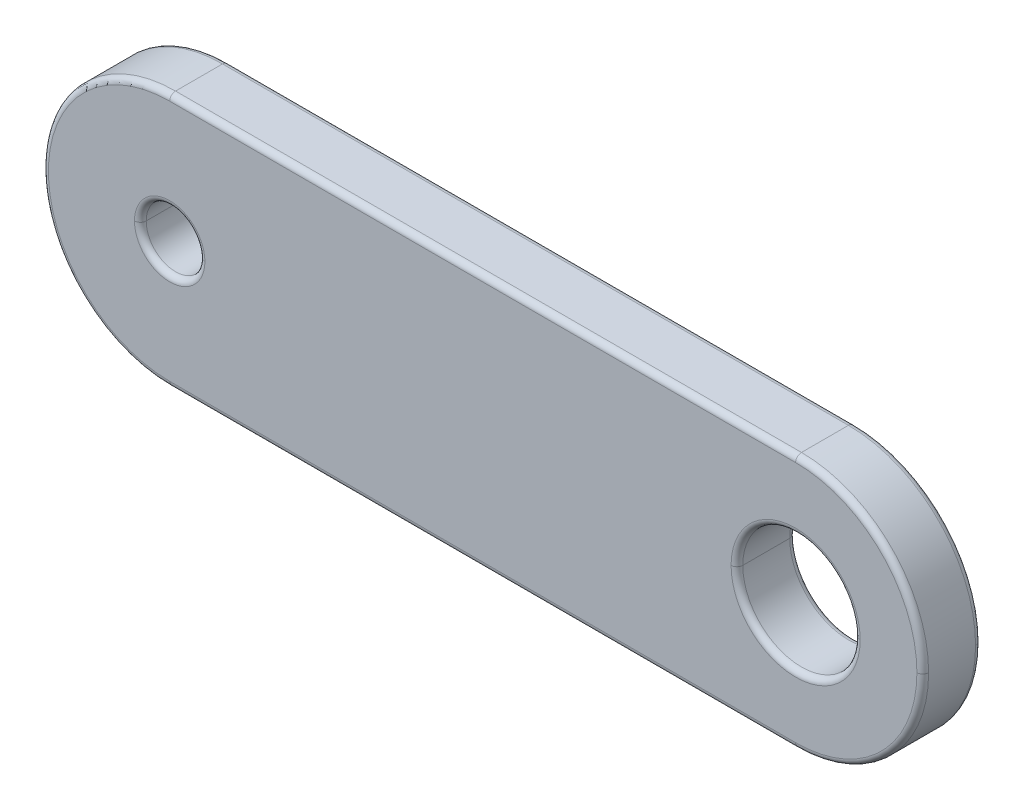
ISO-10303-21;
HEADER;
FILE_DESCRIPTION(('STEP AP214'),'2;1');
FILE_NAME('part.step','',(''),(''),'','','');
FILE_SCHEMA(('AUTOMOTIVE_DESIGN { 1 0 10303 214 1 1 1 1 }'));
ENDSEC;
DATA;
#1=APPLICATION_CONTEXT('core data for automotive mechanical design processes');
#2=APPLICATION_PROTOCOL_DEFINITION('international standard','automotive_design',2000,#1);
#3=PRODUCT_CONTEXT('',#1,'mechanical');
#4=PRODUCT('Part','Part','',(#3));
#5=PRODUCT_RELATED_PRODUCT_CATEGORY('part','',(#4));
#6=PRODUCT_DEFINITION_FORMATION('','',#4);
#7=PRODUCT_DEFINITION_CONTEXT('part definition',#1,'design');
#8=PRODUCT_DEFINITION('design','',#6,#7);
#9=PRODUCT_DEFINITION_SHAPE('','',#8);
#10=(LENGTH_UNIT() NAMED_UNIT(*) SI_UNIT(.MILLI.,.METRE.));
#11=(NAMED_UNIT(*) PLANE_ANGLE_UNIT() SI_UNIT($,.RADIAN.));
#12=(NAMED_UNIT(*) SI_UNIT($,.STERADIAN.) SOLID_ANGLE_UNIT());
#13=UNCERTAINTY_MEASURE_WITH_UNIT(LENGTH_MEASURE(1.E-05),#10,'distance_accuracy_value','');
#14=(GEOMETRIC_REPRESENTATION_CONTEXT(3) GLOBAL_UNCERTAINTY_ASSIGNED_CONTEXT((#13)) GLOBAL_UNIT_ASSIGNED_CONTEXT((#10,
#11,#12)) REPRESENTATION_CONTEXT('',''));
#15=CARTESIAN_POINT('',(0.,0.,0.));
#16=DIRECTION('',(0.,0.,1.));
#17=DIRECTION('',(1.,0.,0.));
#18=AXIS2_PLACEMENT_3D('',#15,#16,#17);
#19=CARTESIAN_POINT('',(-8.,0.,0.6));
#20=DIRECTION('',(0.,0.,1.));
#21=DIRECTION('',(1.,0.,0.));
#22=AXIS2_PLACEMENT_3D('',#19,#20,#21);
#23=TOROIDAL_SURFACE('',#22,0.9,0.15);
#24=CARTESIAN_POINT('',(-8.9,0.,0.6));
#25=DIRECTION('',(0.,1.,0.));
#26=DIRECTION('',(-1.,0.,0.));
#27=AXIS2_PLACEMENT_3D('',#24,#25,#26);
#28=CIRCLE('',#27,0.15);
#29=CARTESIAN_POINT('',(-8.9,0.,0.75));
#30=VERTEX_POINT('',#29);
#31=CARTESIAN_POINT('',(-8.75,0.,0.6));
#32=VERTEX_POINT('',#31);
#33=EDGE_CURVE('E339',#30,#32,#28,.T.);
#34=ORIENTED_EDGE('',*,*,#33,.F.);
#35=CARTESIAN_POINT('',(-8.,0.,0.75));
#36=DIRECTION('',(0.,0.,-1.));
#37=DIRECTION('',(1.,0.,0.));
#38=AXIS2_PLACEMENT_3D('',#35,#36,#37);
#39=CIRCLE('',#38,0.9);
#40=CARTESIAN_POINT('',(-7.1,0.,0.75));
#41=VERTEX_POINT('',#40);
#42=EDGE_CURVE('E276',#41,#30,#39,.T.);
#43=ORIENTED_EDGE('',*,*,#42,.F.);
#44=CARTESIAN_POINT('',(-7.1,0.,0.6));
#45=DIRECTION('',(0.,-1.,0.));
#46=DIRECTION('',(0.,0.,-1.));
#47=AXIS2_PLACEMENT_3D('',#44,#45,#46);
#48=CIRCLE('',#47,0.15);
#49=CARTESIAN_POINT('',(-7.25,0.,0.6));
#50=VERTEX_POINT('',#49);
#51=EDGE_CURVE('E379',#41,#50,#48,.T.);
#52=ORIENTED_EDGE('',*,*,#51,.T.);
#53=CARTESIAN_POINT('',(-8.,0.,0.6));
#54=DIRECTION('',(0.,0.,1.));
#55=DIRECTION('',(1.,0.,0.));
#56=AXIS2_PLACEMENT_3D('',#53,#54,#55);
#57=CIRCLE('',#56,0.75);
#58=EDGE_CURVE('E307',#32,#50,#57,.T.);
#59=ORIENTED_EDGE('',*,*,#58,.F.);
#60=EDGE_LOOP('',(#34,#43,#52,#59));
#61=FACE_BOUND('',#60,.T.);
#62=ADVANCED_FACE('F15',(#61),#23,.T.);
#63=CARTESIAN_POINT('',(-8.,3.1,0.6));
#64=DIRECTION('',(1.,0.,0.));
#65=DIRECTION('',(0.,1.,0.));
#66=AXIS2_PLACEMENT_3D('',#63,#64,#65);
#67=CYLINDRICAL_SURFACE('',#66,0.15);
#68=CARTESIAN_POINT('',(8.,3.1,0.6));
#69=DIRECTION('',(-1.,0.,0.));
#70=DIRECTION('',(0.,0.,1.));
#71=AXIS2_PLACEMENT_3D('',#68,#69,#70);
#72=CIRCLE('',#71,0.15);
#73=CARTESIAN_POINT('',(8.,3.1,0.75));
#74=VERTEX_POINT('',#73);
#75=CARTESIAN_POINT('',(8.,3.25,0.6));
#76=VERTEX_POINT('',#75);
#77=EDGE_CURVE('E26',#74,#76,#72,.T.);
#78=ORIENTED_EDGE('',*,*,#77,.T.);
#79=DIRECTION('',(1.,0.,0.));
#80=VECTOR('',#79,1.);
#81=CARTESIAN_POINT('',(8.,3.25,0.6));
#82=LINE('',#81,#80);
#83=CARTESIAN_POINT('',(-8.,3.25,0.6));
#84=VERTEX_POINT('',#83);
#85=EDGE_CURVE('E193',#84,#76,#82,.T.);
#86=ORIENTED_EDGE('',*,*,#85,.F.);
#87=CARTESIAN_POINT('',(-8.,3.1,0.6));
#88=DIRECTION('',(1.,0.,0.));
#89=DIRECTION('',(0.,0.,-1.));
#90=AXIS2_PLACEMENT_3D('',#87,#88,#89);
#91=CIRCLE('',#90,0.15);
#92=CARTESIAN_POINT('',(-8.,3.1,0.75));
#93=VERTEX_POINT('',#92);
#94=EDGE_CURVE('E10',#84,#93,#91,.T.);
#95=ORIENTED_EDGE('',*,*,#94,.T.);
#96=DIRECTION('',(-1.,0.,0.));
#97=VECTOR('',#96,1.);
#98=CARTESIAN_POINT('',(-8.,3.1,0.75));
#99=LINE('',#98,#97);
#100=EDGE_CURVE('E191',#74,#93,#99,.T.);
#101=ORIENTED_EDGE('',*,*,#100,.F.);
#102=EDGE_LOOP('',(#78,#86,#95,#101));
#103=FACE_BOUND('',#102,.T.);
#104=ADVANCED_FACE('F189',(#103),#67,.T.);
#105=CARTESIAN_POINT('',(-8.,0.,0.6));
#106=DIRECTION('',(0.,0.,1.));
#107=DIRECTION('',(1.,0.,0.));
#108=AXIS2_PLACEMENT_3D('',#105,#106,#107);
#109=TOROIDAL_SURFACE('',#108,3.1,0.15);
#110=CARTESIAN_POINT('',(-8.,-3.1,0.6));
#111=DIRECTION('',(-1.,0.,0.));
#112=DIRECTION('',(0.,0.,1.));
#113=AXIS2_PLACEMENT_3D('',#110,#111,#112);
#114=CIRCLE('',#113,0.15);
#115=CARTESIAN_POINT('',(-8.,-3.25,0.6));
#116=VERTEX_POINT('',#115);
#117=CARTESIAN_POINT('',(-8.,-3.1,0.75));
#118=VERTEX_POINT('',#117);
#119=EDGE_CURVE('E201',#116,#118,#114,.T.);
#120=ORIENTED_EDGE('',*,*,#119,.T.);
#121=CARTESIAN_POINT('',(-8.,0.,0.75));
#122=DIRECTION('',(0.,0.,1.));
#123=DIRECTION('',(1.,0.,0.));
#124=AXIS2_PLACEMENT_3D('',#121,#122,#123);
#125=CIRCLE('',#124,3.1);
#126=EDGE_CURVE('E197',#93,#118,#125,.T.);
#127=ORIENTED_EDGE('',*,*,#126,.F.);
#128=ORIENTED_EDGE('',*,*,#94,.F.);
#129=CARTESIAN_POINT('',(-8.,0.,0.6));
#130=DIRECTION('',(0.,0.,-1.));
#131=DIRECTION('',(1.,0.,0.));
#132=AXIS2_PLACEMENT_3D('',#129,#130,#131);
#133=CIRCLE('',#132,3.25);
#134=CARTESIAN_POINT('',(-11.25,0.,0.6));
#135=VERTEX_POINT('',#134);
#136=EDGE_CURVE('E263',#135,#84,#133,.T.);
#137=ORIENTED_EDGE('',*,*,#136,.F.);
#138=CARTESIAN_POINT('',(-8.,0.,0.6));
#139=DIRECTION('',(0.,0.,-1.));
#140=DIRECTION('',(1.,0.,0.));
#141=AXIS2_PLACEMENT_3D('',#138,#139,#140);
#142=CIRCLE('',#141,3.25);
#143=EDGE_CURVE('E332',#116,#135,#142,.T.);
#144=ORIENTED_EDGE('',*,*,#143,.F.);
#145=EDGE_LOOP('',(#120,#127,#128,#137,#144));
#146=FACE_BOUND('',#145,.T.);
#147=ADVANCED_FACE('F198',(#146),#109,.T.);
#148=CARTESIAN_POINT('',(8.,0.,0.6));
#149=DIRECTION('',(0.,0.,1.));
#150=DIRECTION('',(1.,0.,0.));
#151=AXIS2_PLACEMENT_3D('',#148,#149,#150);
#152=TOROIDAL_SURFACE('',#151,3.1,0.15);
#153=CARTESIAN_POINT('',(11.1,0.,0.6));
#154=DIRECTION('',(0.,-1.,0.));
#155=DIRECTION('',(0.,0.,-1.));
#156=AXIS2_PLACEMENT_3D('',#153,#154,#155);
#157=CIRCLE('',#156,0.15);
#158=CARTESIAN_POINT('',(11.25,0.,0.6));
#159=VERTEX_POINT('',#158);
#160=CARTESIAN_POINT('',(11.1,0.,0.75));
#161=VERTEX_POINT('',#160);
#162=EDGE_CURVE('E239',#159,#161,#157,.T.);
#163=ORIENTED_EDGE('',*,*,#162,.F.);
#164=CARTESIAN_POINT('',(8.,0.,0.6));
#165=DIRECTION('',(0.,0.,-1.));
#166=DIRECTION('',(1.,0.,0.));
#167=AXIS2_PLACEMENT_3D('',#164,#165,#166);
#168=CIRCLE('',#167,3.25);
#169=EDGE_CURVE('E285',#76,#159,#168,.T.);
#170=ORIENTED_EDGE('',*,*,#169,.F.);
#171=ORIENTED_EDGE('',*,*,#77,.F.);
#172=CARTESIAN_POINT('',(8.,0.,0.75));
#173=DIRECTION('',(0.,0.,1.));
#174=DIRECTION('',(1.,0.,0.));
#175=AXIS2_PLACEMENT_3D('',#172,#173,#174);
#176=CIRCLE('',#175,3.1);
#177=EDGE_CURVE('E209',#161,#74,#176,.T.);
#178=ORIENTED_EDGE('',*,*,#177,.F.);
#179=EDGE_LOOP('',(#163,#170,#171,#178));
#180=FACE_BOUND('',#179,.T.);
#181=ADVANCED_FACE('F517',(#180),#152,.T.);
#182=CARTESIAN_POINT('',(-8.,-3.1,0.6));
#183=DIRECTION('',(-1.,0.,0.));
#184=DIRECTION('',(0.,-1.,0.));
#185=AXIS2_PLACEMENT_3D('',#182,#183,#184);
#186=CYLINDRICAL_SURFACE('',#185,0.15);
#187=ORIENTED_EDGE('',*,*,#119,.F.);
#188=DIRECTION('',(-1.,0.,0.));
#189=VECTOR('',#188,1.);
#190=CARTESIAN_POINT('',(-8.,-3.25,0.6));
#191=LINE('',#190,#189);
#192=CARTESIAN_POINT('',(8.,-3.25,0.6));
#193=VERTEX_POINT('',#192);
#194=EDGE_CURVE('E294',#193,#116,#191,.T.);
#195=ORIENTED_EDGE('',*,*,#194,.F.);
#196=CARTESIAN_POINT('',(8.,-3.1,0.6));
#197=DIRECTION('',(1.,0.,0.));
#198=DIRECTION('',(0.,0.,-1.));
#199=AXIS2_PLACEMENT_3D('',#196,#197,#198);
#200=CIRCLE('',#199,0.15);
#201=CARTESIAN_POINT('',(8.,-3.1,0.75));
#202=VERTEX_POINT('',#201);
#203=EDGE_CURVE('E249',#202,#193,#200,.T.);
#204=ORIENTED_EDGE('',*,*,#203,.F.);
#205=DIRECTION('',(1.,0.,0.));
#206=VECTOR('',#205,1.);
#207=CARTESIAN_POINT('',(8.,-3.1,0.75));
#208=LINE('',#207,#206);
#209=EDGE_CURVE('E205',#118,#202,#208,.T.);
#210=ORIENTED_EDGE('',*,*,#209,.F.);
#211=EDGE_LOOP('',(#187,#195,#204,#210));
#212=FACE_BOUND('',#211,.T.);
#213=ADVANCED_FACE('F514',(#212),#186,.T.);
#214=CARTESIAN_POINT('',(8.,0.,0.6));
#215=DIRECTION('',(0.,0.,1.));
#216=DIRECTION('',(1.,0.,0.));
#217=AXIS2_PLACEMENT_3D('',#214,#215,#216);
#218=TOROIDAL_SURFACE('',#217,1.65,0.15);
#219=CARTESIAN_POINT('',(6.35,0.,0.6));
#220=DIRECTION('',(0.,1.,0.));
#221=DIRECTION('',(-1.,0.,0.));
#222=AXIS2_PLACEMENT_3D('',#219,#220,#221);
#223=CIRCLE('',#222,0.15);
#224=CARTESIAN_POINT('',(6.35,0.,0.75));
#225=VERTEX_POINT('',#224);
#226=CARTESIAN_POINT('',(6.5,0.,0.6));
#227=VERTEX_POINT('',#226);
#228=EDGE_CURVE('E226',#225,#227,#223,.T.);
#229=ORIENTED_EDGE('',*,*,#228,.F.);
#230=CARTESIAN_POINT('',(8.,0.,0.75));
#231=DIRECTION('',(0.,0.,-1.));
#232=DIRECTION('',(1.,0.,0.));
#233=AXIS2_PLACEMENT_3D('',#230,#231,#232);
#234=CIRCLE('',#233,1.65);
#235=CARTESIAN_POINT('',(9.65,0.,0.75));
#236=VERTEX_POINT('',#235);
#237=EDGE_CURVE('E392',#236,#225,#234,.T.);
#238=ORIENTED_EDGE('',*,*,#237,.F.);
#239=CARTESIAN_POINT('',(9.65,0.,0.6));
#240=DIRECTION('',(0.,-1.,0.));
#241=DIRECTION('',(0.,0.,-1.));
#242=AXIS2_PLACEMENT_3D('',#239,#240,#241);
#243=CIRCLE('',#242,0.15);
#244=CARTESIAN_POINT('',(9.5,0.,0.6));
#245=VERTEX_POINT('',#244);
#246=EDGE_CURVE('E225',#236,#245,#243,.T.);
#247=ORIENTED_EDGE('',*,*,#246,.T.);
#248=CARTESIAN_POINT('',(8.,0.,0.6));
#249=DIRECTION('',(0.,0.,1.));
#250=DIRECTION('',(1.,0.,0.));
#251=AXIS2_PLACEMENT_3D('',#248,#249,#250);
#252=CIRCLE('',#251,1.5);
#253=EDGE_CURVE('E309',#227,#245,#252,.T.);
#254=ORIENTED_EDGE('',*,*,#253,.F.);
#255=EDGE_LOOP('',(#229,#238,#247,#254));
#256=FACE_BOUND('',#255,.T.);
#257=ADVANCED_FACE('F17',(#256),#218,.T.);
#258=CARTESIAN_POINT('',(-8.,-3.1,-0.6));
#259=DIRECTION('',(1.,0.,0.));
#260=DIRECTION('',(0.,1.,0.));
#261=AXIS2_PLACEMENT_3D('',#258,#259,#260);
#262=CYLINDRICAL_SURFACE('',#261,0.15);
#263=CARTESIAN_POINT('',(-8.,-3.1,-0.6));
#264=DIRECTION('',(1.,0.,0.));
#265=DIRECTION('',(0.,0.,-1.));
#266=AXIS2_PLACEMENT_3D('',#263,#264,#265);
#267=CIRCLE('',#266,0.15);
#268=CARTESIAN_POINT('',(-8.,-3.25,-0.6));
#269=VERTEX_POINT('',#268);
#270=CARTESIAN_POINT('',(-8.,-3.1,-0.75));
#271=VERTEX_POINT('',#270);
#272=EDGE_CURVE('E250',#269,#271,#267,.T.);
#273=ORIENTED_EDGE('',*,*,#272,.T.);
#274=DIRECTION('',(-1.,0.,0.));
#275=VECTOR('',#274,1.);
#276=CARTESIAN_POINT('',(-8.,-3.1,-0.75));
#277=LINE('',#276,#275);
#278=CARTESIAN_POINT('',(8.,-3.1,-0.75));
#279=VERTEX_POINT('',#278);
#280=EDGE_CURVE('E238',#279,#271,#277,.T.);
#281=ORIENTED_EDGE('',*,*,#280,.F.);
#282=CARTESIAN_POINT('',(8.,-3.1,-0.6));
#283=DIRECTION('',(-1.,0.,0.));
#284=DIRECTION('',(0.,0.,1.));
#285=AXIS2_PLACEMENT_3D('',#282,#283,#284);
#286=CIRCLE('',#285,0.15);
#287=CARTESIAN_POINT('',(8.,-3.25,-0.6));
#288=VERTEX_POINT('',#287);
#289=EDGE_CURVE('E227',#279,#288,#286,.T.);
#290=ORIENTED_EDGE('',*,*,#289,.T.);
#291=DIRECTION('',(1.,0.,0.));
#292=VECTOR('',#291,1.);
#293=CARTESIAN_POINT('',(-8.,-3.25,-0.6));
#294=LINE('',#293,#292);
#295=EDGE_CURVE('E268',#269,#288,#294,.T.);
#296=ORIENTED_EDGE('',*,*,#295,.F.);
#297=EDGE_LOOP('',(#273,#281,#290,#296));
#298=FACE_BOUND('',#297,.T.);
#299=ADVANCED_FACE('F509',(#298),#262,.T.);
#300=CARTESIAN_POINT('',(8.,0.,-0.6));
#301=DIRECTION('',(0.,0.,1.));
#302=DIRECTION('',(1.,0.,0.));
#303=AXIS2_PLACEMENT_3D('',#300,#301,#302);
#304=TOROIDAL_SURFACE('',#303,3.1,0.15);
#305=CARTESIAN_POINT('',(11.1,0.,-0.6));
#306=DIRECTION('',(0.,-1.,0.));
#307=DIRECTION('',(0.,0.,-1.));
#308=AXIS2_PLACEMENT_3D('',#305,#306,#307);
#309=CIRCLE('',#308,0.15);
#310=CARTESIAN_POINT('',(11.1,0.,-0.75));
#311=VERTEX_POINT('',#310);
#312=CARTESIAN_POINT('',(11.25,0.,-0.6));
#313=VERTEX_POINT('',#312);
#314=EDGE_CURVE('E380',#311,#313,#309,.T.);
#315=ORIENTED_EDGE('',*,*,#314,.F.);
#316=CARTESIAN_POINT('',(8.,0.,-0.75));
#317=DIRECTION('',(0.,0.,-1.));
#318=DIRECTION('',(1.,0.,0.));
#319=AXIS2_PLACEMENT_3D('',#316,#317,#318);
#320=CIRCLE('',#319,3.1);
#321=CARTESIAN_POINT('',(8.,3.1,-0.75));
#322=VERTEX_POINT('',#321);
#323=EDGE_CURVE('E158',#322,#311,#320,.T.);
#324=ORIENTED_EDGE('',*,*,#323,.F.);
#325=CARTESIAN_POINT('',(8.,3.1,-0.6));
#326=DIRECTION('',(1.,0.,0.));
#327=DIRECTION('',(0.,0.,-1.));
#328=AXIS2_PLACEMENT_3D('',#325,#326,#327);
#329=CIRCLE('',#328,0.15);
#330=CARTESIAN_POINT('',(8.,3.25,-0.6));
#331=VERTEX_POINT('',#330);
#332=EDGE_CURVE('E272',#322,#331,#329,.T.);
#333=ORIENTED_EDGE('',*,*,#332,.T.);
#334=CARTESIAN_POINT('',(8.,0.,-0.6));
#335=DIRECTION('',(0.,0.,1.));
#336=DIRECTION('',(1.,0.,0.));
#337=AXIS2_PLACEMENT_3D('',#334,#335,#336);
#338=CIRCLE('',#337,3.25);
#339=EDGE_CURVE('E286',#313,#331,#338,.T.);
#340=ORIENTED_EDGE('',*,*,#339,.F.);
#341=EDGE_LOOP('',(#315,#324,#333,#340));
#342=FACE_BOUND('',#341,.T.);
#343=ADVANCED_FACE('F512',(#342),#304,.T.);
#344=CARTESIAN_POINT('',(-8.,0.,-0.6));
#345=DIRECTION('',(0.,0.,1.));
#346=DIRECTION('',(1.,0.,0.));
#347=AXIS2_PLACEMENT_3D('',#344,#345,#346);
#348=TOROIDAL_SURFACE('',#347,3.1,0.15);
#349=CARTESIAN_POINT('',(-8.,3.1,-0.6));
#350=DIRECTION('',(-1.,0.,0.));
#351=DIRECTION('',(0.,0.,1.));
#352=AXIS2_PLACEMENT_3D('',#349,#350,#351);
#353=CIRCLE('',#352,0.15);
#354=CARTESIAN_POINT('',(-8.,3.25,-0.6));
#355=VERTEX_POINT('',#354);
#356=CARTESIAN_POINT('',(-8.,3.1,-0.75));
#357=VERTEX_POINT('',#356);
#358=EDGE_CURVE('E253',#355,#357,#353,.T.);
#359=ORIENTED_EDGE('',*,*,#358,.T.);
#360=CARTESIAN_POINT('',(-8.,0.,-0.75));
#361=DIRECTION('',(0.,0.,-1.));
#362=DIRECTION('',(1.,0.,0.));
#363=AXIS2_PLACEMENT_3D('',#360,#361,#362);
#364=CIRCLE('',#363,3.1);
#365=EDGE_CURVE('E233',#271,#357,#364,.T.);
#366=ORIENTED_EDGE('',*,*,#365,.F.);
#367=ORIENTED_EDGE('',*,*,#272,.F.);
#368=CARTESIAN_POINT('',(-8.,0.,-0.6));
#369=DIRECTION('',(0.,0.,1.));
#370=DIRECTION('',(1.,0.,0.));
#371=AXIS2_PLACEMENT_3D('',#368,#369,#370);
#372=CIRCLE('',#371,3.25);
#373=CARTESIAN_POINT('',(-11.25,0.,-0.6));
#374=VERTEX_POINT('',#373);
#375=EDGE_CURVE('E256',#374,#269,#372,.T.);
#376=ORIENTED_EDGE('',*,*,#375,.F.);
#377=CARTESIAN_POINT('',(-8.,0.,-0.6));
#378=DIRECTION('',(0.,0.,1.));
#379=DIRECTION('',(1.,0.,0.));
#380=AXIS2_PLACEMENT_3D('',#377,#378,#379);
#381=CIRCLE('',#380,3.25);
#382=EDGE_CURVE('E265',#355,#374,#381,.T.);
#383=ORIENTED_EDGE('',*,*,#382,.F.);
#384=EDGE_LOOP('',(#359,#366,#367,#376,#383));
#385=FACE_BOUND('',#384,.T.);
#386=ADVANCED_FACE('F532',(#385),#348,.T.);
#387=CARTESIAN_POINT('',(-8.,3.1,-0.6));
#388=DIRECTION('',(-1.,0.,0.));
#389=DIRECTION('',(0.,-1.,0.));
#390=AXIS2_PLACEMENT_3D('',#387,#388,#389);
#391=CYLINDRICAL_SURFACE('',#390,0.15);
#392=ORIENTED_EDGE('',*,*,#332,.F.);
#393=DIRECTION('',(1.,0.,0.));
#394=VECTOR('',#393,1.);
#395=CARTESIAN_POINT('',(-8.,3.1,-0.75));
#396=LINE('',#395,#394);
#397=EDGE_CURVE('E237',#357,#322,#396,.T.);
#398=ORIENTED_EDGE('',*,*,#397,.F.);
#399=ORIENTED_EDGE('',*,*,#358,.F.);
#400=DIRECTION('',(-1.,0.,0.));
#401=VECTOR('',#400,1.);
#402=CARTESIAN_POINT('',(-8.,3.25,-0.6));
#403=LINE('',#402,#401);
#404=EDGE_CURVE('E273',#331,#355,#403,.T.);
#405=ORIENTED_EDGE('',*,*,#404,.F.);
#406=EDGE_LOOP('',(#392,#398,#399,#405));
#407=FACE_BOUND('',#406,.T.);
#408=ADVANCED_FACE('F535',(#407),#391,.T.);
#409=CARTESIAN_POINT('',(-8.,0.,-0.6));
#410=DIRECTION('',(0.,0.,1.));
#411=DIRECTION('',(1.,0.,0.));
#412=AXIS2_PLACEMENT_3D('',#409,#410,#411);
#413=TOROIDAL_SURFACE('',#412,0.9,0.15);
#414=CARTESIAN_POINT('',(-8.9,0.,-0.6));
#415=DIRECTION('',(0.,1.,0.));
#416=DIRECTION('',(-1.,0.,0.));
#417=AXIS2_PLACEMENT_3D('',#414,#415,#416);
#418=CIRCLE('',#417,0.15);
#419=CARTESIAN_POINT('',(-8.75,0.,-0.6));
#420=VERTEX_POINT('',#419);
#421=CARTESIAN_POINT('',(-8.9,0.,-0.75));
#422=VERTEX_POINT('',#421);
#423=EDGE_CURVE('E289',#420,#422,#418,.T.);
#424=ORIENTED_EDGE('',*,*,#423,.F.);
#425=CARTESIAN_POINT('',(-8.,0.,-0.6));
#426=DIRECTION('',(0.,0.,-1.));
#427=DIRECTION('',(1.,0.,0.));
#428=AXIS2_PLACEMENT_3D('',#425,#426,#427);
#429=CIRCLE('',#428,0.75);
#430=CARTESIAN_POINT('',(-7.25,0.,-0.6));
#431=VERTEX_POINT('',#430);
#432=EDGE_CURVE('E220',#431,#420,#429,.T.);
#433=ORIENTED_EDGE('',*,*,#432,.F.);
#434=CARTESIAN_POINT('',(-7.1,0.,-0.6));
#435=DIRECTION('',(0.,-1.,0.));
#436=DIRECTION('',(0.,0.,-1.));
#437=AXIS2_PLACEMENT_3D('',#434,#435,#436);
#438=CIRCLE('',#437,0.15);
#439=CARTESIAN_POINT('',(-7.1,0.,-0.75));
#440=VERTEX_POINT('',#439);
#441=EDGE_CURVE('E333',#431,#440,#438,.T.);
#442=ORIENTED_EDGE('',*,*,#441,.T.);
#443=CARTESIAN_POINT('',(-8.,0.,-0.75));
#444=DIRECTION('',(0.,0.,1.));
#445=DIRECTION('',(1.,0.,0.));
#446=AXIS2_PLACEMENT_3D('',#443,#444,#445);
#447=CIRCLE('',#446,0.9);
#448=EDGE_CURVE('E260',#422,#440,#447,.T.);
#449=ORIENTED_EDGE('',*,*,#448,.F.);
#450=EDGE_LOOP('',(#424,#433,#442,#449));
#451=FACE_BOUND('',#450,.T.);
#452=ADVANCED_FACE('F461',(#451),#413,.T.);
#453=CARTESIAN_POINT('',(8.,0.,-0.6));
#454=DIRECTION('',(0.,0.,1.));
#455=DIRECTION('',(1.,0.,0.));
#456=AXIS2_PLACEMENT_3D('',#453,#454,#455);
#457=TOROIDAL_SURFACE('',#456,1.65,0.15);
#458=CARTESIAN_POINT('',(6.35,0.,-0.6));
#459=DIRECTION('',(0.,1.,0.));
#460=DIRECTION('',(-1.,0.,0.));
#461=AXIS2_PLACEMENT_3D('',#458,#459,#460);
#462=CIRCLE('',#461,0.15);
#463=CARTESIAN_POINT('',(6.5,0.,-0.6));
#464=VERTEX_POINT('',#463);
#465=CARTESIAN_POINT('',(6.35,0.,-0.75));
#466=VERTEX_POINT('',#465);
#467=EDGE_CURVE('E345',#464,#466,#462,.T.);
#468=ORIENTED_EDGE('',*,*,#467,.F.);
#469=CARTESIAN_POINT('',(8.,0.,-0.6));
#470=DIRECTION('',(0.,0.,-1.));
#471=DIRECTION('',(1.,0.,0.));
#472=AXIS2_PLACEMENT_3D('',#469,#470,#471);
#473=CIRCLE('',#472,1.5);
#474=CARTESIAN_POINT('',(9.5,0.,-0.6));
#475=VERTEX_POINT('',#474);
#476=EDGE_CURVE('E296',#475,#464,#473,.T.);
#477=ORIENTED_EDGE('',*,*,#476,.F.);
#478=CARTESIAN_POINT('',(9.65,0.,-0.6));
#479=DIRECTION('',(0.,-1.,0.));
#480=DIRECTION('',(0.,0.,-1.));
#481=AXIS2_PLACEMENT_3D('',#478,#479,#480);
#482=CIRCLE('',#481,0.15);
#483=CARTESIAN_POINT('',(9.65,0.,-0.75));
#484=VERTEX_POINT('',#483);
#485=EDGE_CURVE('E314',#475,#484,#482,.T.);
#486=ORIENTED_EDGE('',*,*,#485,.T.);
#487=CARTESIAN_POINT('',(8.,0.,-0.75));
#488=DIRECTION('',(0.,0.,1.));
#489=DIRECTION('',(1.,0.,0.));
#490=AXIS2_PLACEMENT_3D('',#487,#488,#489);
#491=CIRCLE('',#490,1.65);
#492=EDGE_CURVE('E264',#466,#484,#491,.T.);
#493=ORIENTED_EDGE('',*,*,#492,.F.);
#494=EDGE_LOOP('',(#468,#477,#486,#493));
#495=FACE_BOUND('',#494,.T.);
#496=ADVANCED_FACE('F475',(#495),#457,.T.);
#497=CARTESIAN_POINT('',(8.,0.,0.75));
#498=DIRECTION('',(0.,0.,-1.));
#499=DIRECTION('',(-1.,0.,0.));
#500=AXIS2_PLACEMENT_3D('',#497,#498,#499);
#501=CYLINDRICAL_SURFACE('',#500,1.5);
#502=DIRECTION('',(0.,0.,-1.));
#503=VECTOR('',#502,1.);
#504=CARTESIAN_POINT('',(9.5,0.,0.75));
#505=LINE('',#504,#503);
#506=EDGE_CURVE('E19',#245,#475,#505,.T.);
#507=ORIENTED_EDGE('',*,*,#506,.F.);
#508=CARTESIAN_POINT('',(8.,0.,0.6));
#509=DIRECTION('',(0.,0.,1.));
#510=DIRECTION('',(1.,0.,0.));
#511=AXIS2_PLACEMENT_3D('',#508,#509,#510);
#512=CIRCLE('',#511,1.5);
#513=EDGE_CURVE('E222',#245,#227,#512,.T.);
#514=ORIENTED_EDGE('',*,*,#513,.T.);
#515=DIRECTION('',(0.,0.,-1.));
#516=VECTOR('',#515,1.);
#517=CARTESIAN_POINT('',(6.5,0.,0.75));
#518=LINE('',#517,#516);
#519=EDGE_CURVE('E299',#227,#464,#518,.T.);
#520=ORIENTED_EDGE('',*,*,#519,.T.);
#521=CARTESIAN_POINT('',(8.,0.,-0.6));
#522=DIRECTION('',(0.,0.,-1.));
#523=DIRECTION('',(1.,0.,0.));
#524=AXIS2_PLACEMENT_3D('',#521,#522,#523);
#525=CIRCLE('',#524,1.5);
#526=EDGE_CURVE('E337',#464,#475,#525,.T.);
#527=ORIENTED_EDGE('',*,*,#526,.T.);
#528=EDGE_LOOP('',(#507,#514,#520,#527));
#529=FACE_BOUND('',#528,.T.);
#530=ADVANCED_FACE('F477',(#529),#501,.F.);
#531=CARTESIAN_POINT('',(-8.,0.,0.75));
#532=DIRECTION('',(0.,0.,-1.));
#533=DIRECTION('',(-1.,0.,0.));
#534=AXIS2_PLACEMENT_3D('',#531,#532,#533);
#535=CYLINDRICAL_SURFACE('',#534,0.75);
#536=DIRECTION('',(0.,0.,-1.));
#537=VECTOR('',#536,1.);
#538=CARTESIAN_POINT('',(-7.25,0.,0.75));
#539=LINE('',#538,#537);
#540=EDGE_CURVE('E441',#50,#431,#539,.T.);
#541=ORIENTED_EDGE('',*,*,#540,.F.);
#542=CARTESIAN_POINT('',(-8.,0.,0.6));
#543=DIRECTION('',(0.,0.,1.));
#544=DIRECTION('',(1.,0.,0.));
#545=AXIS2_PLACEMENT_3D('',#542,#543,#544);
#546=CIRCLE('',#545,0.75);
#547=EDGE_CURVE('E343',#50,#32,#546,.T.);
#548=ORIENTED_EDGE('',*,*,#547,.T.);
#549=DIRECTION('',(0.,0.,-1.));
#550=VECTOR('',#549,1.);
#551=CARTESIAN_POINT('',(-8.75,0.,0.75));
#552=LINE('',#551,#550);
#553=EDGE_CURVE('E329',#32,#420,#552,.T.);
#554=ORIENTED_EDGE('',*,*,#553,.T.);
#555=CARTESIAN_POINT('',(-8.,0.,-0.6));
#556=DIRECTION('',(0.,0.,-1.));
#557=DIRECTION('',(1.,0.,0.));
#558=AXIS2_PLACEMENT_3D('',#555,#556,#557);
#559=CIRCLE('',#558,0.75);
#560=EDGE_CURVE('E231',#420,#431,#559,.T.);
#561=ORIENTED_EDGE('',*,*,#560,.T.);
#562=EDGE_LOOP('',(#541,#548,#554,#561));
#563=FACE_BOUND('',#562,.T.);
#564=ADVANCED_FACE('F548',(#563),#535,.F.);
#565=CARTESIAN_POINT('',(-8.,3.25,0.75));
#566=DIRECTION('',(0.,-1.,0.));
#567=DIRECTION('',(0.,0.,-1.));
#568=AXIS2_PLACEMENT_3D('',#565,#566,#567);
#569=PLANE('',#568);
#570=DIRECTION('',(0.,0.,-1.));
#571=VECTOR('',#570,1.);
#572=CARTESIAN_POINT('',(8.,3.25,0.75));
#573=LINE('',#572,#571);
#574=EDGE_CURVE('E281',#76,#331,#573,.T.);
#575=ORIENTED_EDGE('',*,*,#574,.T.);
#576=ORIENTED_EDGE('',*,*,#404,.T.);
#577=DIRECTION('',(0.,0.,-1.));
#578=VECTOR('',#577,1.);
#579=CARTESIAN_POINT('',(-8.,3.25,0.75));
#580=LINE('',#579,#578);
#581=EDGE_CURVE('E269',#84,#355,#580,.T.);
#582=ORIENTED_EDGE('',*,*,#581,.F.);
#583=ORIENTED_EDGE('',*,*,#85,.T.);
#584=EDGE_LOOP('',(#575,#576,#582,#583));
#585=FACE_BOUND('',#584,.T.);
#586=ADVANCED_FACE('F551',(#585),#569,.F.);
#587=CARTESIAN_POINT('',(8.,0.,0.75));
#588=DIRECTION('',(0.,0.,-1.));
#589=DIRECTION('',(-1.,0.,0.));
#590=AXIS2_PLACEMENT_3D('',#587,#588,#589);
#591=CYLINDRICAL_SURFACE('',#590,3.25);
#592=DIRECTION('',(0.,0.,-1.));
#593=VECTOR('',#592,1.);
#594=CARTESIAN_POINT('',(8.,-3.25,0.75));
#595=LINE('',#594,#593);
#596=EDGE_CURVE('E291',#193,#288,#595,.T.);
#597=ORIENTED_EDGE('',*,*,#596,.T.);
#598=CARTESIAN_POINT('',(8.,0.,-0.6));
#599=DIRECTION('',(0.,0.,1.));
#600=DIRECTION('',(1.,0.,0.));
#601=AXIS2_PLACEMENT_3D('',#598,#599,#600);
#602=CIRCLE('',#601,3.25);
#603=EDGE_CURVE('E232',#288,#313,#602,.T.);
#604=ORIENTED_EDGE('',*,*,#603,.T.);
#605=ORIENTED_EDGE('',*,*,#339,.T.);
#606=ORIENTED_EDGE('',*,*,#574,.F.);
#607=ORIENTED_EDGE('',*,*,#169,.T.);
#608=CARTESIAN_POINT('',(8.,0.,0.6));
#609=DIRECTION('',(0.,0.,-1.));
#610=DIRECTION('',(1.,0.,0.));
#611=AXIS2_PLACEMENT_3D('',#608,#609,#610);
#612=CIRCLE('',#611,3.25);
#613=EDGE_CURVE('E244',#159,#193,#612,.T.);
#614=ORIENTED_EDGE('',*,*,#613,.T.);
#615=EDGE_LOOP('',(#597,#604,#605,#606,#607,#614));
#616=FACE_BOUND('',#615,.T.);
#617=ADVANCED_FACE('F507',(#616),#591,.T.);
#618=CARTESIAN_POINT('',(-8.,-3.25,0.75));
#619=DIRECTION('',(0.,1.,0.));
#620=DIRECTION('',(1.,0.,0.));
#621=AXIS2_PLACEMENT_3D('',#618,#619,#620);
#622=PLANE('',#621);
#623=DIRECTION('',(0.,0.,-1.));
#624=VECTOR('',#623,1.);
#625=CARTESIAN_POINT('',(-8.,-3.25,0.75));
#626=LINE('',#625,#624);
#627=EDGE_CURVE('E216',#116,#269,#626,.T.);
#628=ORIENTED_EDGE('',*,*,#627,.T.);
#629=ORIENTED_EDGE('',*,*,#295,.T.);
#630=ORIENTED_EDGE('',*,*,#596,.F.);
#631=ORIENTED_EDGE('',*,*,#194,.T.);
#632=EDGE_LOOP('',(#628,#629,#630,#631));
#633=FACE_BOUND('',#632,.T.);
#634=ADVANCED_FACE('F527',(#633),#622,.F.);
#635=CARTESIAN_POINT('',(-8.,0.,0.75));
#636=DIRECTION('',(0.,0.,-1.));
#637=DIRECTION('',(-1.,0.,0.));
#638=AXIS2_PLACEMENT_3D('',#635,#636,#637);
#639=CYLINDRICAL_SURFACE('',#638,3.25);
#640=DIRECTION('',(0.,0.,-1.));
#641=VECTOR('',#640,1.);
#642=CARTESIAN_POINT('',(-11.25,0.,0.75));
#643=LINE('',#642,#641);
#644=EDGE_CURVE('E353',#135,#374,#643,.T.);
#645=ORIENTED_EDGE('',*,*,#644,.F.);
#646=ORIENTED_EDGE('',*,*,#136,.T.);
#647=ORIENTED_EDGE('',*,*,#581,.T.);
#648=ORIENTED_EDGE('',*,*,#382,.T.);
#649=EDGE_LOOP('',(#645,#646,#647,#648));
#650=FACE_BOUND('',#649,.T.);
#651=ADVANCED_FACE('F467',(#650),#639,.T.);
#652=CARTESIAN_POINT('',(-8.,0.,-0.75));
#653=DIRECTION('',(0.,0.,1.));
#654=DIRECTION('',(1.,0.,0.));
#655=AXIS2_PLACEMENT_3D('',#652,#653,#654);
#656=PLANE('',#655);
#657=CARTESIAN_POINT('',(-8.,0.,-0.75));
#658=DIRECTION('',(0.,0.,1.));
#659=DIRECTION('',(1.,0.,0.));
#660=AXIS2_PLACEMENT_3D('',#657,#658,#659);
#661=CIRCLE('',#660,0.9);
#662=EDGE_CURVE('E338',#440,#422,#661,.T.);
#663=ORIENTED_EDGE('',*,*,#662,.T.);
#664=ORIENTED_EDGE('',*,*,#448,.T.);
#665=EDGE_LOOP('',(#663,#664));
#666=FACE_BOUND('',#665,.T.);
#667=CARTESIAN_POINT('',(8.,0.,-0.75));
#668=DIRECTION('',(0.,0.,1.));
#669=DIRECTION('',(1.,0.,0.));
#670=AXIS2_PLACEMENT_3D('',#667,#668,#669);
#671=CIRCLE('',#670,1.65);
#672=EDGE_CURVE('E321',#484,#466,#671,.T.);
#673=ORIENTED_EDGE('',*,*,#672,.T.);
#674=ORIENTED_EDGE('',*,*,#492,.T.);
#675=EDGE_LOOP('',(#673,#674));
#676=FACE_BOUND('',#675,.T.);
#677=ORIENTED_EDGE('',*,*,#323,.T.);
#678=CARTESIAN_POINT('',(8.,0.,-0.75));
#679=DIRECTION('',(0.,0.,-1.));
#680=DIRECTION('',(1.,0.,0.));
#681=AXIS2_PLACEMENT_3D('',#678,#679,#680);
#682=CIRCLE('',#681,3.1);
#683=EDGE_CURVE('E280',#311,#279,#682,.T.);
#684=ORIENTED_EDGE('',*,*,#683,.T.);
#685=ORIENTED_EDGE('',*,*,#280,.T.);
#686=ORIENTED_EDGE('',*,*,#365,.T.);
#687=ORIENTED_EDGE('',*,*,#397,.T.);
#688=EDGE_LOOP('',(#677,#684,#685,#686,#687));
#689=FACE_BOUND('',#688,.T.);
#690=ADVANCED_FACE('F464',(#666,#676,#689),#656,.F.);
#691=CARTESIAN_POINT('',(-8.,0.,0.75));
#692=DIRECTION('',(0.,0.,1.));
#693=DIRECTION('',(1.,0.,0.));
#694=AXIS2_PLACEMENT_3D('',#691,#692,#693);
#695=PLANE('',#694);
#696=ORIENTED_EDGE('',*,*,#42,.T.);
#697=CARTESIAN_POINT('',(-8.,0.,0.75));
#698=DIRECTION('',(0.,0.,-1.));
#699=DIRECTION('',(1.,0.,0.));
#700=AXIS2_PLACEMENT_3D('',#697,#698,#699);
#701=CIRCLE('',#700,0.9);
#702=EDGE_CURVE('E344',#30,#41,#701,.T.);
#703=ORIENTED_EDGE('',*,*,#702,.T.);
#704=EDGE_LOOP('',(#696,#703));
#705=FACE_BOUND('',#704,.T.);
#706=ORIENTED_EDGE('',*,*,#237,.T.);
#707=CARTESIAN_POINT('',(8.,0.,0.75));
#708=DIRECTION('',(0.,0.,-1.));
#709=DIRECTION('',(1.,0.,0.));
#710=AXIS2_PLACEMENT_3D('',#707,#708,#709);
#711=CIRCLE('',#710,1.65);
#712=EDGE_CURVE('E245',#225,#236,#711,.T.);
#713=ORIENTED_EDGE('',*,*,#712,.T.);
#714=EDGE_LOOP('',(#706,#713));
#715=FACE_BOUND('',#714,.T.);
#716=CARTESIAN_POINT('',(8.,0.,0.75));
#717=DIRECTION('',(0.,0.,1.));
#718=DIRECTION('',(1.,0.,0.));
#719=AXIS2_PLACEMENT_3D('',#716,#717,#718);
#720=CIRCLE('',#719,3.1);
#721=EDGE_CURVE('E243',#202,#161,#720,.T.);
#722=ORIENTED_EDGE('',*,*,#721,.T.);
#723=ORIENTED_EDGE('',*,*,#177,.T.);
#724=ORIENTED_EDGE('',*,*,#100,.T.);
#725=ORIENTED_EDGE('',*,*,#126,.T.);
#726=ORIENTED_EDGE('',*,*,#209,.T.);
#727=EDGE_LOOP('',(#722,#723,#724,#725,#726));
#728=FACE_BOUND('',#727,.T.);
#729=ADVANCED_FACE('F208',(#705,#715,#728),#695,.T.);
#730=CARTESIAN_POINT('',(-8.,0.,0.75));
#731=DIRECTION('',(0.,0.,-1.));
#732=DIRECTION('',(-1.,0.,0.));
#733=AXIS2_PLACEMENT_3D('',#730,#731,#732);
#734=CYLINDRICAL_SURFACE('',#733,3.25);
#735=ORIENTED_EDGE('',*,*,#143,.T.);
#736=ORIENTED_EDGE('',*,*,#644,.T.);
#737=ORIENTED_EDGE('',*,*,#375,.T.);
#738=ORIENTED_EDGE('',*,*,#627,.F.);
#739=EDGE_LOOP('',(#735,#736,#737,#738));
#740=FACE_BOUND('',#739,.T.);
#741=ADVANCED_FACE('F488',(#740),#734,.T.);
#742=CARTESIAN_POINT('',(-8.,0.,0.75));
#743=DIRECTION('',(0.,0.,-1.));
#744=DIRECTION('',(-1.,0.,0.));
#745=AXIS2_PLACEMENT_3D('',#742,#743,#744);
#746=CYLINDRICAL_SURFACE('',#745,0.75);
#747=ORIENTED_EDGE('',*,*,#58,.T.);
#748=ORIENTED_EDGE('',*,*,#540,.T.);
#749=ORIENTED_EDGE('',*,*,#432,.T.);
#750=ORIENTED_EDGE('',*,*,#553,.F.);
#751=EDGE_LOOP('',(#747,#748,#749,#750));
#752=FACE_BOUND('',#751,.T.);
#753=ADVANCED_FACE('F495',(#752),#746,.F.);
#754=CARTESIAN_POINT('',(8.,0.,0.75));
#755=DIRECTION('',(0.,0.,-1.));
#756=DIRECTION('',(-1.,0.,0.));
#757=AXIS2_PLACEMENT_3D('',#754,#755,#756);
#758=CYLINDRICAL_SURFACE('',#757,1.5);
#759=ORIENTED_EDGE('',*,*,#253,.T.);
#760=ORIENTED_EDGE('',*,*,#506,.T.);
#761=ORIENTED_EDGE('',*,*,#476,.T.);
#762=ORIENTED_EDGE('',*,*,#519,.F.);
#763=EDGE_LOOP('',(#759,#760,#761,#762));
#764=FACE_BOUND('',#763,.T.);
#765=ADVANCED_FACE('F479',(#764),#758,.F.);
#766=CARTESIAN_POINT('',(8.,0.,-0.6));
#767=DIRECTION('',(0.,0.,1.));
#768=DIRECTION('',(1.,0.,0.));
#769=AXIS2_PLACEMENT_3D('',#766,#767,#768);
#770=TOROIDAL_SURFACE('',#769,1.65,0.15);
#771=ORIENTED_EDGE('',*,*,#526,.F.);
#772=ORIENTED_EDGE('',*,*,#467,.T.);
#773=ORIENTED_EDGE('',*,*,#672,.F.);
#774=ORIENTED_EDGE('',*,*,#485,.F.);
#775=EDGE_LOOP('',(#771,#772,#773,#774));
#776=FACE_BOUND('',#775,.T.);
#777=ADVANCED_FACE('F473',(#776),#770,.T.);
#778=CARTESIAN_POINT('',(-8.,0.,-0.6));
#779=DIRECTION('',(0.,0.,1.));
#780=DIRECTION('',(1.,0.,0.));
#781=AXIS2_PLACEMENT_3D('',#778,#779,#780);
#782=TOROIDAL_SURFACE('',#781,0.9,0.15);
#783=ORIENTED_EDGE('',*,*,#560,.F.);
#784=ORIENTED_EDGE('',*,*,#423,.T.);
#785=ORIENTED_EDGE('',*,*,#662,.F.);
#786=ORIENTED_EDGE('',*,*,#441,.F.);
#787=EDGE_LOOP('',(#783,#784,#785,#786));
#788=FACE_BOUND('',#787,.T.);
#789=ADVANCED_FACE('F458',(#788),#782,.T.);
#790=CARTESIAN_POINT('',(8.,0.,-0.6));
#791=DIRECTION('',(0.,0.,1.));
#792=DIRECTION('',(1.,0.,0.));
#793=AXIS2_PLACEMENT_3D('',#790,#791,#792);
#794=TOROIDAL_SURFACE('',#793,3.1,0.15);
#795=ORIENTED_EDGE('',*,*,#683,.F.);
#796=ORIENTED_EDGE('',*,*,#314,.T.);
#797=ORIENTED_EDGE('',*,*,#603,.F.);
#798=ORIENTED_EDGE('',*,*,#289,.F.);
#799=EDGE_LOOP('',(#795,#796,#797,#798));
#800=FACE_BOUND('',#799,.T.);
#801=ADVANCED_FACE('F553',(#800),#794,.T.);
#802=CARTESIAN_POINT('',(8.,0.,0.6));
#803=DIRECTION('',(0.,0.,1.));
#804=DIRECTION('',(1.,0.,0.));
#805=AXIS2_PLACEMENT_3D('',#802,#803,#804);
#806=TOROIDAL_SURFACE('',#805,1.65,0.15);
#807=ORIENTED_EDGE('',*,*,#712,.F.);
#808=ORIENTED_EDGE('',*,*,#228,.T.);
#809=ORIENTED_EDGE('',*,*,#513,.F.);
#810=ORIENTED_EDGE('',*,*,#246,.F.);
#811=EDGE_LOOP('',(#807,#808,#809,#810));
#812=FACE_BOUND('',#811,.T.);
#813=ADVANCED_FACE('F485',(#812),#806,.T.);
#814=CARTESIAN_POINT('',(8.,0.,0.6));
#815=DIRECTION('',(0.,0.,1.));
#816=DIRECTION('',(1.,0.,0.));
#817=AXIS2_PLACEMENT_3D('',#814,#815,#816);
#818=TOROIDAL_SURFACE('',#817,3.1,0.15);
#819=ORIENTED_EDGE('',*,*,#613,.F.);
#820=ORIENTED_EDGE('',*,*,#162,.T.);
#821=ORIENTED_EDGE('',*,*,#721,.F.);
#822=ORIENTED_EDGE('',*,*,#203,.T.);
#823=EDGE_LOOP('',(#819,#820,#821,#822));
#824=FACE_BOUND('',#823,.T.);
#825=ADVANCED_FACE('F519',(#824),#818,.T.);
#826=CARTESIAN_POINT('',(-8.,0.,0.6));
#827=DIRECTION('',(0.,0.,1.));
#828=DIRECTION('',(1.,0.,0.));
#829=AXIS2_PLACEMENT_3D('',#826,#827,#828);
#830=TOROIDAL_SURFACE('',#829,0.9,0.15);
#831=ORIENTED_EDGE('',*,*,#702,.F.);
#832=ORIENTED_EDGE('',*,*,#33,.T.);
#833=ORIENTED_EDGE('',*,*,#547,.F.);
#834=ORIENTED_EDGE('',*,*,#51,.F.);
#835=EDGE_LOOP('',(#831,#832,#833,#834));
#836=FACE_BOUND('',#835,.T.);
#837=ADVANCED_FACE('F522',(#836),#830,.T.);
#838=CLOSED_SHELL('',(#62,#104,#147,#181,#213,#257,#299,#343,#386,#408,#452,#496,#530,#564,#586,
#617,#634,#651,#690,#729,#741,#753,#765,#777,#789,#801,#813,#825,#837));
#839=MANIFOLD_SOLID_BREP('B1',#838);
#840=ADVANCED_BREP_SHAPE_REPRESENTATION('',(#18,#839),#14);
#841=SHAPE_DEFINITION_REPRESENTATION(#9,#840);
ENDSEC;
END-ISO-10303-21;
